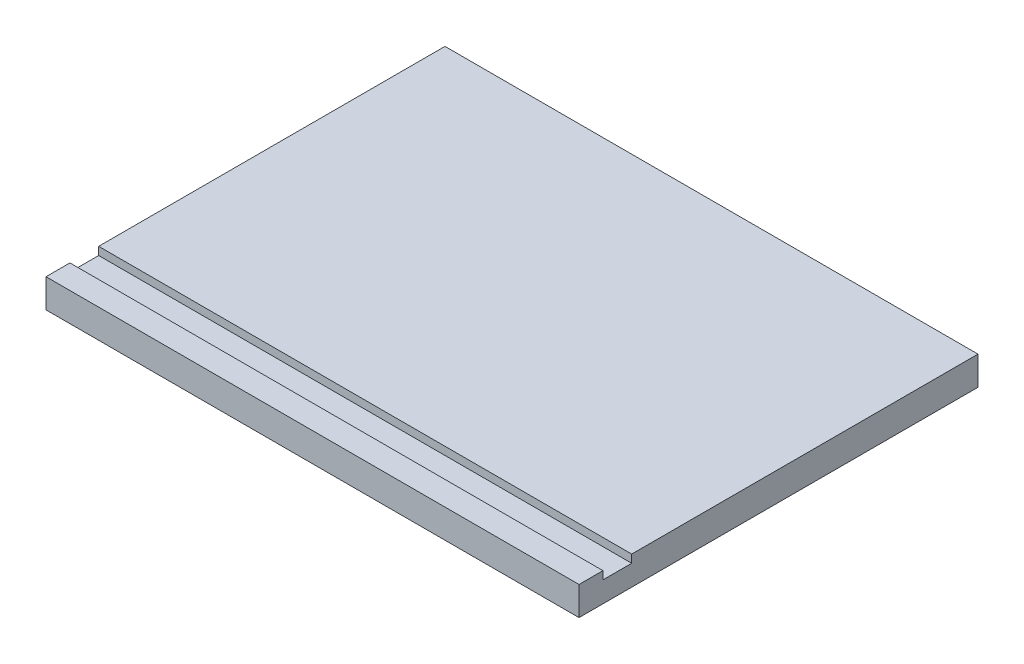
ISO-10303-21;
HEADER;
FILE_DESCRIPTION(('STEP AP214'),'2;1');
FILE_NAME('part.step','',(''),(''),'','','');
FILE_SCHEMA(('AUTOMOTIVE_DESIGN { 1 0 10303 214 1 1 1 1 }'));
ENDSEC;
DATA;
#1=APPLICATION_CONTEXT('core data for automotive mechanical design processes');
#2=APPLICATION_PROTOCOL_DEFINITION('international standard','automotive_design',2000,#1);
#3=PRODUCT_CONTEXT('',#1,'mechanical');
#4=PRODUCT('Part','Part','',(#3));
#5=PRODUCT_RELATED_PRODUCT_CATEGORY('part','',(#4));
#6=PRODUCT_DEFINITION_FORMATION('','',#4);
#7=PRODUCT_DEFINITION_CONTEXT('part definition',#1,'design');
#8=PRODUCT_DEFINITION('design','',#6,#7);
#9=PRODUCT_DEFINITION_SHAPE('','',#8);
#10=(LENGTH_UNIT() NAMED_UNIT(*) SI_UNIT(.MILLI.,.METRE.));
#11=(NAMED_UNIT(*) PLANE_ANGLE_UNIT() SI_UNIT($,.RADIAN.));
#12=(NAMED_UNIT(*) SI_UNIT($,.STERADIAN.) SOLID_ANGLE_UNIT());
#13=UNCERTAINTY_MEASURE_WITH_UNIT(LENGTH_MEASURE(1.E-05),#10,'distance_accuracy_value','');
#14=(GEOMETRIC_REPRESENTATION_CONTEXT(3) GLOBAL_UNCERTAINTY_ASSIGNED_CONTEXT((#13)) GLOBAL_UNIT_ASSIGNED_CONTEXT((#10,
#11,#12)) REPRESENTATION_CONTEXT('',''));
#15=CARTESIAN_POINT('',(0.,0.,0.));
#16=DIRECTION('',(0.,0.,1.));
#17=DIRECTION('',(1.,0.,0.));
#18=AXIS2_PLACEMENT_3D('',#15,#16,#17);
#19=CARTESIAN_POINT('',(0.,18.,0.));
#20=DIRECTION('',(0.,1.,0.));
#21=DIRECTION('',(0.,0.,1.));
#22=AXIS2_PLACEMENT_3D('',#19,#20,#21);
#23=PLANE('',#22);
#24=DIRECTION('',(-1.,0.,0.));
#25=VECTOR('',#24,1.);
#26=CARTESIAN_POINT('',(-167.,18.,92.0000000000001));
#27=LINE('',#26,#25);
#28=CARTESIAN_POINT('',(167.,18.,92.0000000000001));
#29=VERTEX_POINT('',#28);
#30=CARTESIAN_POINT('',(-167.,18.,92.0000000000001));
#31=VERTEX_POINT('',#30);
#32=EDGE_CURVE('E125',#29,#31,#27,.T.);
#33=ORIENTED_EDGE('',*,*,#32,.F.);
#34=DIRECTION('',(0.,0.,-1.));
#35=VECTOR('',#34,1.);
#36=CARTESIAN_POINT('',(167.,18.,125.));
#37=LINE('',#36,#35);
#38=CARTESIAN_POINT('',(167.,18.,-125.));
#39=VERTEX_POINT('',#38);
#40=EDGE_CURVE('E138',#29,#39,#37,.T.);
#41=ORIENTED_EDGE('',*,*,#40,.T.);
#42=DIRECTION('',(-1.,0.,0.));
#43=VECTOR('',#42,1.);
#44=CARTESIAN_POINT('',(167.,18.,-125.));
#45=LINE('',#44,#43);
#46=CARTESIAN_POINT('',(-167.,18.,-125.));
#47=VERTEX_POINT('',#46);
#48=EDGE_CURVE('E59',#39,#47,#45,.T.);
#49=ORIENTED_EDGE('',*,*,#48,.T.);
#50=DIRECTION('',(0.,0.,1.));
#51=VECTOR('',#50,1.);
#52=CARTESIAN_POINT('',(-167.,18.,125.));
#53=LINE('',#52,#51);
#54=EDGE_CURVE('E134',#47,#31,#53,.T.);
#55=ORIENTED_EDGE('',*,*,#54,.T.);
#56=EDGE_LOOP('',(#33,#41,#49,#55));
#57=FACE_BOUND('',#56,.T.);
#58=ADVANCED_FACE('F35',(#57),#23,.T.);
#59=CARTESIAN_POINT('',(-167.,18.,125.));
#60=DIRECTION('',(1.,0.,0.));
#61=DIRECTION('',(0.,0.,-1.));
#62=AXIS2_PLACEMENT_3D('',#59,#60,#61);
#63=PLANE('',#62);
#64=DIRECTION('',(0.,0.,1.));
#65=VECTOR('',#64,1.);
#66=CARTESIAN_POINT('',(-167.,13.,110.));
#67=LINE('',#66,#65);
#68=CARTESIAN_POINT('',(-167.,13.,92.0000000000001));
#69=VERTEX_POINT('',#68);
#70=CARTESIAN_POINT('',(-167.,13.,110.));
#71=VERTEX_POINT('',#70);
#72=EDGE_CURVE('E116',#69,#71,#67,.T.);
#73=ORIENTED_EDGE('',*,*,#72,.F.);
#74=DIRECTION('',(0.,1.,0.));
#75=VECTOR('',#74,1.);
#76=CARTESIAN_POINT('',(-167.,13.,92.0000000000001));
#77=LINE('',#76,#75);
#78=EDGE_CURVE('E148',#69,#31,#77,.T.);
#79=ORIENTED_EDGE('',*,*,#78,.T.);
#80=ORIENTED_EDGE('',*,*,#54,.F.);
#81=DIRECTION('',(0.,-1.,0.));
#82=VECTOR('',#81,1.);
#83=CARTESIAN_POINT('',(-167.,18.,-125.));
#84=LINE('',#83,#82);
#85=CARTESIAN_POINT('',(-167.,0.,-125.));
#86=VERTEX_POINT('',#85);
#87=EDGE_CURVE('E143',#47,#86,#84,.T.);
#88=ORIENTED_EDGE('',*,*,#87,.T.);
#89=DIRECTION('',(0.,0.,1.));
#90=VECTOR('',#89,1.);
#91=CARTESIAN_POINT('',(-167.,0.,125.));
#92=LINE('',#91,#90);
#93=CARTESIAN_POINT('',(-167.,0.,125.));
#94=VERTEX_POINT('',#93);
#95=EDGE_CURVE('E144',#86,#94,#92,.T.);
#96=ORIENTED_EDGE('',*,*,#95,.T.);
#97=DIRECTION('',(0.,-1.,0.));
#98=VECTOR('',#97,1.);
#99=CARTESIAN_POINT('',(-167.,18.,125.));
#100=LINE('',#99,#98);
#101=CARTESIAN_POINT('',(-167.,18.,125.));
#102=VERTEX_POINT('',#101);
#103=EDGE_CURVE('E11',#102,#94,#100,.T.);
#104=ORIENTED_EDGE('',*,*,#103,.F.);
#105=CARTESIAN_POINT('',(-167.,18.,110.));
#106=VERTEX_POINT('',#105);
#107=EDGE_CURVE('E87',#106,#102,#53,.T.);
#108=ORIENTED_EDGE('',*,*,#107,.F.);
#109=DIRECTION('',(0.,1.,0.));
#110=VECTOR('',#109,1.);
#111=CARTESIAN_POINT('',(-167.,13.,110.));
#112=LINE('',#111,#110);
#113=EDGE_CURVE('E50',#71,#106,#112,.T.);
#114=ORIENTED_EDGE('',*,*,#113,.F.);
#115=EDGE_LOOP('',(#73,#79,#80,#88,#96,#104,#108,#114));
#116=FACE_BOUND('',#115,.T.);
#117=ADVANCED_FACE('F37',(#116),#63,.F.);
#118=CARTESIAN_POINT('',(167.,18.,125.));
#119=DIRECTION('',(0.,0.,-1.));
#120=DIRECTION('',(-1.,0.,0.));
#121=AXIS2_PLACEMENT_3D('',#118,#119,#120);
#122=PLANE('',#121);
#123=DIRECTION('',(1.,0.,0.));
#124=VECTOR('',#123,1.);
#125=CARTESIAN_POINT('',(167.,0.,125.));
#126=LINE('',#125,#124);
#127=CARTESIAN_POINT('',(167.,0.,125.));
#128=VERTEX_POINT('',#127);
#129=EDGE_CURVE('E147',#94,#128,#126,.T.);
#130=ORIENTED_EDGE('',*,*,#129,.T.);
#131=DIRECTION('',(0.,-1.,0.));
#132=VECTOR('',#131,1.);
#133=CARTESIAN_POINT('',(167.,18.,125.));
#134=LINE('',#133,#132);
#135=CARTESIAN_POINT('',(167.,18.,125.));
#136=VERTEX_POINT('',#135);
#137=EDGE_CURVE('E43',#136,#128,#134,.T.);
#138=ORIENTED_EDGE('',*,*,#137,.F.);
#139=DIRECTION('',(1.,0.,0.));
#140=VECTOR('',#139,1.);
#141=CARTESIAN_POINT('',(167.,18.,125.));
#142=LINE('',#141,#140);
#143=EDGE_CURVE('E136',#102,#136,#142,.T.);
#144=ORIENTED_EDGE('',*,*,#143,.F.);
#145=ORIENTED_EDGE('',*,*,#103,.T.);
#146=EDGE_LOOP('',(#130,#138,#144,#145));
#147=FACE_BOUND('',#146,.T.);
#148=ADVANCED_FACE('F192',(#147),#122,.F.);
#149=CARTESIAN_POINT('',(167.,18.,125.));
#150=DIRECTION('',(-1.,0.,0.));
#151=DIRECTION('',(0.,0.,1.));
#152=AXIS2_PLACEMENT_3D('',#149,#150,#151);
#153=PLANE('',#152);
#154=ORIENTED_EDGE('',*,*,#40,.F.);
#155=DIRECTION('',(0.,1.,0.));
#156=VECTOR('',#155,1.);
#157=CARTESIAN_POINT('',(167.,13.,92.0000000000001));
#158=LINE('',#157,#156);
#159=CARTESIAN_POINT('',(167.,13.,92.0000000000001));
#160=VERTEX_POINT('',#159);
#161=EDGE_CURVE('E129',#160,#29,#158,.T.);
#162=ORIENTED_EDGE('',*,*,#161,.F.);
#163=DIRECTION('',(0.,0.,-1.));
#164=VECTOR('',#163,1.);
#165=CARTESIAN_POINT('',(167.,13.,110.));
#166=LINE('',#165,#164);
#167=CARTESIAN_POINT('',(167.,13.,110.));
#168=VERTEX_POINT('',#167);
#169=EDGE_CURVE('E115',#168,#160,#166,.T.);
#170=ORIENTED_EDGE('',*,*,#169,.F.);
#171=DIRECTION('',(0.,1.,0.));
#172=VECTOR('',#171,1.);
#173=CARTESIAN_POINT('',(167.,13.,110.));
#174=LINE('',#173,#172);
#175=CARTESIAN_POINT('',(167.,18.,110.));
#176=VERTEX_POINT('',#175);
#177=EDGE_CURVE('E112',#168,#176,#174,.T.);
#178=ORIENTED_EDGE('',*,*,#177,.T.);
#179=EDGE_CURVE('E139',#136,#176,#37,.T.);
#180=ORIENTED_EDGE('',*,*,#179,.F.);
#181=ORIENTED_EDGE('',*,*,#137,.T.);
#182=DIRECTION('',(0.,0.,-1.));
#183=VECTOR('',#182,1.);
#184=CARTESIAN_POINT('',(167.,0.,125.));
#185=LINE('',#184,#183);
#186=CARTESIAN_POINT('',(167.,0.,-125.));
#187=VERTEX_POINT('',#186);
#188=EDGE_CURVE('E150',#128,#187,#185,.T.);
#189=ORIENTED_EDGE('',*,*,#188,.T.);
#190=DIRECTION('',(0.,-1.,0.));
#191=VECTOR('',#190,1.);
#192=CARTESIAN_POINT('',(167.,18.,-125.));
#193=LINE('',#192,#191);
#194=EDGE_CURVE('E154',#39,#187,#193,.T.);
#195=ORIENTED_EDGE('',*,*,#194,.F.);
#196=EDGE_LOOP('',(#154,#162,#170,#178,#180,#181,#189,#195));
#197=FACE_BOUND('',#196,.T.);
#198=ADVANCED_FACE('F161',(#197),#153,.F.);
#199=CARTESIAN_POINT('',(167.,18.,-125.));
#200=DIRECTION('',(0.,0.,1.));
#201=DIRECTION('',(1.,0.,0.));
#202=AXIS2_PLACEMENT_3D('',#199,#200,#201);
#203=PLANE('',#202);
#204=DIRECTION('',(-1.,0.,0.));
#205=VECTOR('',#204,1.);
#206=CARTESIAN_POINT('',(167.,0.,-125.));
#207=LINE('',#206,#205);
#208=EDGE_CURVE('E80',#187,#86,#207,.T.);
#209=ORIENTED_EDGE('',*,*,#208,.T.);
#210=ORIENTED_EDGE('',*,*,#87,.F.);
#211=ORIENTED_EDGE('',*,*,#48,.F.);
#212=ORIENTED_EDGE('',*,*,#194,.T.);
#213=EDGE_LOOP('',(#209,#210,#211,#212));
#214=FACE_BOUND('',#213,.T.);
#215=ADVANCED_FACE('F168',(#214),#203,.F.);
#216=DIRECTION('',(1.,0.,0.));
#217=VECTOR('',#216,1.);
#218=CARTESIAN_POINT('',(-167.,18.,110.));
#219=LINE('',#218,#217);
#220=EDGE_CURVE('E172',#106,#176,#219,.T.);
#221=ORIENTED_EDGE('',*,*,#220,.F.);
#222=ORIENTED_EDGE('',*,*,#107,.T.);
#223=ORIENTED_EDGE('',*,*,#143,.T.);
#224=ORIENTED_EDGE('',*,*,#179,.T.);
#225=EDGE_LOOP('',(#221,#222,#223,#224));
#226=FACE_BOUND('',#225,.T.);
#227=ADVANCED_FACE('F184',(#226),#23,.T.);
#228=CARTESIAN_POINT('',(0.,0.,0.));
#229=DIRECTION('',(0.,1.,0.));
#230=DIRECTION('',(0.,0.,1.));
#231=AXIS2_PLACEMENT_3D('',#228,#229,#230);
#232=PLANE('',#231);
#233=ORIENTED_EDGE('',*,*,#95,.F.);
#234=ORIENTED_EDGE('',*,*,#208,.F.);
#235=ORIENTED_EDGE('',*,*,#188,.F.);
#236=ORIENTED_EDGE('',*,*,#129,.F.);
#237=EDGE_LOOP('',(#233,#234,#235,#236));
#238=FACE_BOUND('',#237,.T.);
#239=ADVANCED_FACE('F166',(#238),#232,.F.);
#240=CARTESIAN_POINT('',(-167.,13.,92.0000000000001));
#241=DIRECTION('',(0.,0.,-1.));
#242=DIRECTION('',(-1.,0.,0.));
#243=AXIS2_PLACEMENT_3D('',#240,#241,#242);
#244=PLANE('',#243);
#245=ORIENTED_EDGE('',*,*,#32,.T.);
#246=ORIENTED_EDGE('',*,*,#78,.F.);
#247=DIRECTION('',(-1.,0.,0.));
#248=VECTOR('',#247,1.);
#249=CARTESIAN_POINT('',(-167.,13.,92.0000000000001));
#250=LINE('',#249,#248);
#251=EDGE_CURVE('E122',#160,#69,#250,.T.);
#252=ORIENTED_EDGE('',*,*,#251,.F.);
#253=ORIENTED_EDGE('',*,*,#161,.T.);
#254=EDGE_LOOP('',(#245,#246,#252,#253));
#255=FACE_BOUND('',#254,.T.);
#256=ADVANCED_FACE('F176',(#255),#244,.F.);
#257=CARTESIAN_POINT('',(-167.,13.,110.));
#258=DIRECTION('',(0.,0.,1.));
#259=DIRECTION('',(1.,0.,0.));
#260=AXIS2_PLACEMENT_3D('',#257,#258,#259);
#261=PLANE('',#260);
#262=ORIENTED_EDGE('',*,*,#220,.T.);
#263=ORIENTED_EDGE('',*,*,#177,.F.);
#264=DIRECTION('',(1.,0.,0.));
#265=VECTOR('',#264,1.);
#266=CARTESIAN_POINT('',(-167.,13.,110.));
#267=LINE('',#266,#265);
#268=EDGE_CURVE('E108',#71,#168,#267,.T.);
#269=ORIENTED_EDGE('',*,*,#268,.F.);
#270=ORIENTED_EDGE('',*,*,#113,.T.);
#271=EDGE_LOOP('',(#262,#263,#269,#270));
#272=FACE_BOUND('',#271,.T.);
#273=ADVANCED_FACE('F110',(#272),#261,.F.);
#274=CARTESIAN_POINT('',(0.,13.,0.));
#275=DIRECTION('',(0.,-1.,0.));
#276=DIRECTION('',(0.,0.,-1.));
#277=AXIS2_PLACEMENT_3D('',#274,#275,#276);
#278=PLANE('',#277);
#279=ORIENTED_EDGE('',*,*,#72,.T.);
#280=ORIENTED_EDGE('',*,*,#268,.T.);
#281=ORIENTED_EDGE('',*,*,#169,.T.);
#282=ORIENTED_EDGE('',*,*,#251,.T.);
#283=EDGE_LOOP('',(#279,#280,#281,#282));
#284=FACE_BOUND('',#283,.T.);
#285=ADVANCED_FACE('F120',(#284),#278,.F.);
#286=CLOSED_SHELL('',(#58,#117,#148,#198,#215,#227,#239,#256,#273,#285));
#287=MANIFOLD_SOLID_BREP('B2',#286);
#288=ADVANCED_BREP_SHAPE_REPRESENTATION('',(#18,#287),#14);
#289=SHAPE_DEFINITION_REPRESENTATION(#9,#288);
ENDSEC;
END-ISO-10303-21;
